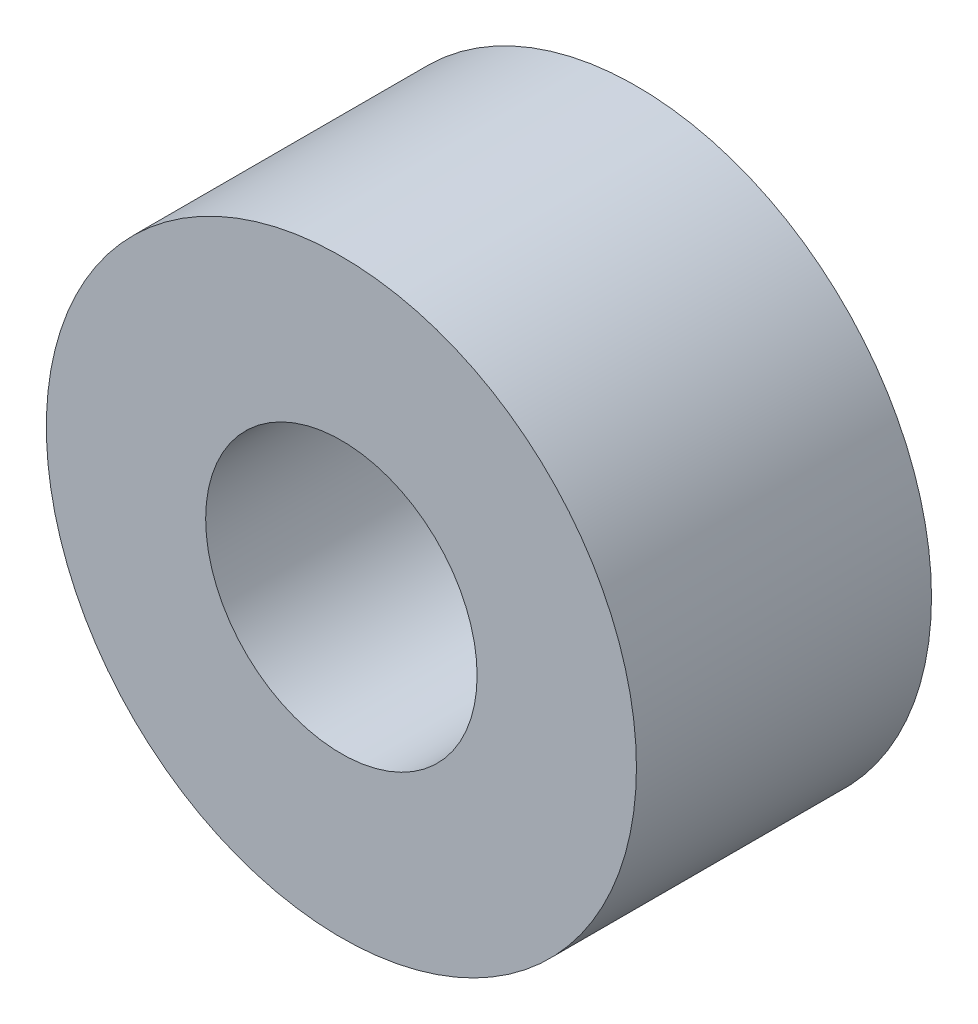
ISO-10303-21;
HEADER;
FILE_DESCRIPTION(('STEP AP214'),'2;1');
FILE_NAME('part.step','',(''),(''),'','','');
FILE_SCHEMA(('AUTOMOTIVE_DESIGN { 1 0 10303 214 1 1 1 1 }'));
ENDSEC;
DATA;
#1=APPLICATION_CONTEXT('core data for automotive mechanical design processes');
#2=APPLICATION_PROTOCOL_DEFINITION('international standard','automotive_design',2000,#1);
#3=PRODUCT_CONTEXT('',#1,'mechanical');
#4=PRODUCT('Part','Part','',(#3));
#5=PRODUCT_RELATED_PRODUCT_CATEGORY('part','',(#4));
#6=PRODUCT_DEFINITION_FORMATION('','',#4);
#7=PRODUCT_DEFINITION_CONTEXT('part definition',#1,'design');
#8=PRODUCT_DEFINITION('design','',#6,#7);
#9=PRODUCT_DEFINITION_SHAPE('','',#8);
#10=(LENGTH_UNIT() NAMED_UNIT(*) SI_UNIT(.MILLI.,.METRE.));
#11=(NAMED_UNIT(*) PLANE_ANGLE_UNIT() SI_UNIT($,.RADIAN.));
#12=(NAMED_UNIT(*) SI_UNIT($,.STERADIAN.) SOLID_ANGLE_UNIT());
#13=UNCERTAINTY_MEASURE_WITH_UNIT(LENGTH_MEASURE(1.E-05),#10,'distance_accuracy_value','');
#14=(GEOMETRIC_REPRESENTATION_CONTEXT(3) GLOBAL_UNCERTAINTY_ASSIGNED_CONTEXT((#13)) GLOBAL_UNIT_ASSIGNED_CONTEXT((#10,
#11,#12)) REPRESENTATION_CONTEXT('',''));
#15=CARTESIAN_POINT('',(0.,0.,0.));
#16=DIRECTION('',(0.,0.,1.));
#17=DIRECTION('',(1.,0.,0.));
#18=AXIS2_PLACEMENT_3D('',#15,#16,#17);
#19=CARTESIAN_POINT('',(0.,0.,1.5875));
#20=DIRECTION('',(0.,0.,1.));
#21=DIRECTION('',(1.,0.,0.));
#22=AXIS2_PLACEMENT_3D('',#19,#20,#21);
#23=PLANE('',#22);
#24=CARTESIAN_POINT('',(0.,0.,1.5875));
#25=DIRECTION('',(0.,0.,1.));
#26=DIRECTION('',(1.,0.,0.));
#27=AXIS2_PLACEMENT_3D('',#24,#25,#26);
#28=CIRCLE('',#27,3.175);
#29=CARTESIAN_POINT('',(3.175,0.,1.5875));
#30=VERTEX_POINT('',#29);
#31=EDGE_CURVE('E10',#30,#30,#28,.T.);
#32=ORIENTED_EDGE('',*,*,#31,.T.);
#33=EDGE_LOOP('',(#32));
#34=FACE_BOUND('',#33,.T.);
#35=CARTESIAN_POINT('',(0.,0.,1.5875));
#36=DIRECTION('',(0.,0.,1.));
#37=DIRECTION('',(1.,0.,0.));
#38=AXIS2_PLACEMENT_3D('',#35,#36,#37);
#39=CIRCLE('',#38,1.4605);
#40=CARTESIAN_POINT('',(1.4605,0.,1.5875));
#41=VERTEX_POINT('',#40);
#42=EDGE_CURVE('E41',#41,#41,#39,.T.);
#43=ORIENTED_EDGE('',*,*,#42,.F.);
#44=EDGE_LOOP('',(#43));
#45=FACE_BOUND('',#44,.T.);
#46=ADVANCED_FACE('F30',(#34,#45),#23,.T.);
#47=CARTESIAN_POINT('',(0.,0.,-1.5875));
#48=DIRECTION('',(0.,0.,1.));
#49=DIRECTION('',(1.,0.,0.));
#50=AXIS2_PLACEMENT_3D('',#47,#48,#49);
#51=PLANE('',#50);
#52=CARTESIAN_POINT('',(0.,0.,-1.5875));
#53=DIRECTION('',(0.,0.,1.));
#54=DIRECTION('',(1.,0.,0.));
#55=AXIS2_PLACEMENT_3D('',#52,#53,#54);
#56=CIRCLE('',#55,3.175);
#57=CARTESIAN_POINT('',(3.175,0.,-1.5875));
#58=VERTEX_POINT('',#57);
#59=EDGE_CURVE('E34',#58,#58,#56,.T.);
#60=ORIENTED_EDGE('',*,*,#59,.F.);
#61=EDGE_LOOP('',(#60));
#62=FACE_BOUND('',#61,.T.);
#63=CARTESIAN_POINT('',(0.,0.,-1.5875));
#64=DIRECTION('',(0.,0.,1.));
#65=DIRECTION('',(1.,0.,0.));
#66=AXIS2_PLACEMENT_3D('',#63,#64,#65);
#67=CIRCLE('',#66,1.4605);
#68=CARTESIAN_POINT('',(1.4605,0.,-1.5875));
#69=VERTEX_POINT('',#68);
#70=EDGE_CURVE('E43',#69,#69,#67,.T.);
#71=ORIENTED_EDGE('',*,*,#70,.T.);
#72=EDGE_LOOP('',(#71));
#73=FACE_BOUND('',#72,.T.);
#74=ADVANCED_FACE('F53',(#62,#73),#51,.F.);
#75=CARTESIAN_POINT('',(0.,0.,1.5875));
#76=DIRECTION('',(0.,0.,-1.));
#77=DIRECTION('',(-1.,0.,0.));
#78=AXIS2_PLACEMENT_3D('',#75,#76,#77);
#79=CYLINDRICAL_SURFACE('',#78,3.175);
#80=ORIENTED_EDGE('',*,*,#31,.F.);
#81=EDGE_LOOP('',(#80));
#82=FACE_BOUND('',#81,.T.);
#83=ORIENTED_EDGE('',*,*,#59,.T.);
#84=EDGE_LOOP('',(#83));
#85=FACE_BOUND('',#84,.T.);
#86=ADVANCED_FACE('F32',(#82,#85),#79,.T.);
#87=CARTESIAN_POINT('',(0.,0.,1.5875));
#88=DIRECTION('',(0.,0.,-1.));
#89=DIRECTION('',(-1.,0.,0.));
#90=AXIS2_PLACEMENT_3D('',#87,#88,#89);
#91=CYLINDRICAL_SURFACE('',#90,1.4605);
#92=ORIENTED_EDGE('',*,*,#42,.T.);
#93=EDGE_LOOP('',(#92));
#94=FACE_BOUND('',#93,.T.);
#95=ORIENTED_EDGE('',*,*,#70,.F.);
#96=EDGE_LOOP('',(#95));
#97=FACE_BOUND('',#96,.T.);
#98=ADVANCED_FACE('F49',(#94,#97),#91,.F.);
#99=CLOSED_SHELL('',(#46,#74,#86,#98));
#100=MANIFOLD_SOLID_BREP('B2',#99);
#101=ADVANCED_BREP_SHAPE_REPRESENTATION('',(#18,#100),#14);
#102=SHAPE_DEFINITION_REPRESENTATION(#9,#101);
ENDSEC;
END-ISO-10303-21;
